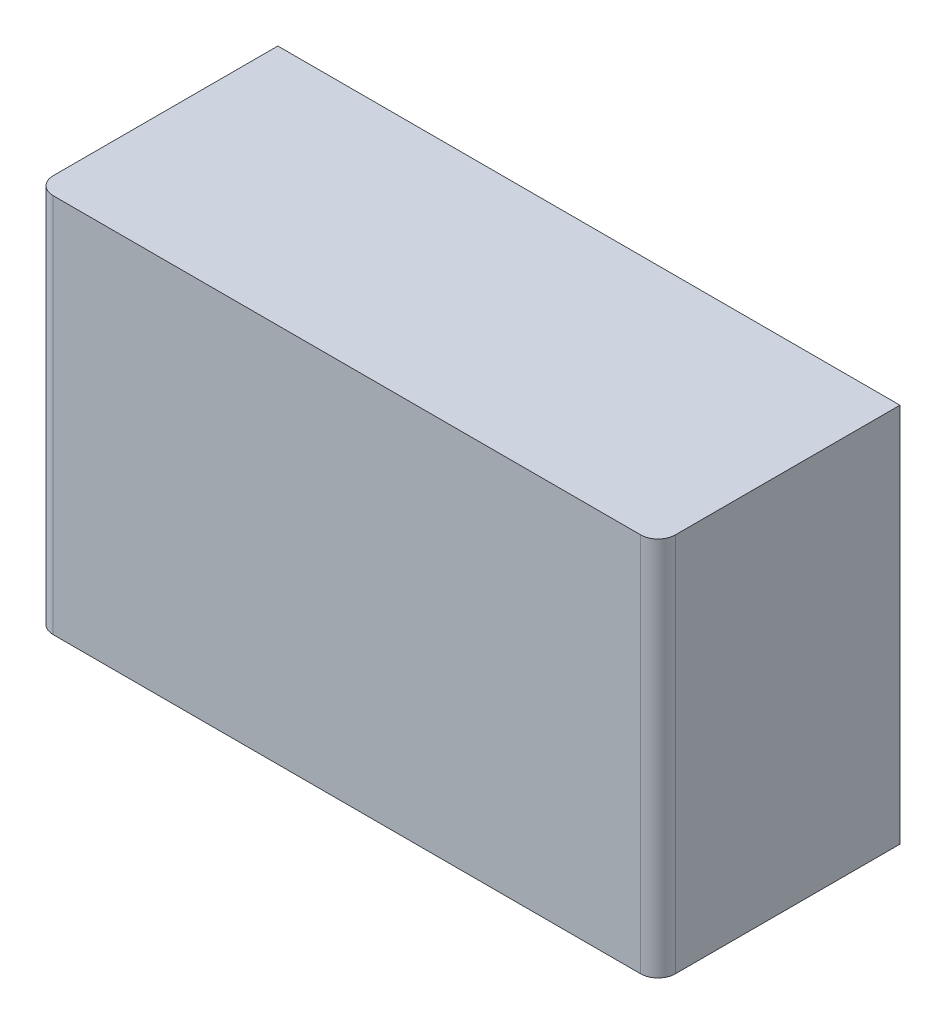
ISO-10303-21;
HEADER;
FILE_DESCRIPTION(('STEP AP214'),'2;1');
FILE_NAME('part.step','',(''),(''),'','','');
FILE_SCHEMA(('AUTOMOTIVE_DESIGN { 1 0 10303 214 1 1 1 1 }'));
ENDSEC;
DATA;
#1=APPLICATION_CONTEXT('core data for automotive mechanical design processes');
#2=APPLICATION_PROTOCOL_DEFINITION('international standard','automotive_design',2000,#1);
#3=PRODUCT_CONTEXT('',#1,'mechanical');
#4=PRODUCT('Part','Part','',(#3));
#5=PRODUCT_RELATED_PRODUCT_CATEGORY('part','',(#4));
#6=PRODUCT_DEFINITION_FORMATION('','',#4);
#7=PRODUCT_DEFINITION_CONTEXT('part definition',#1,'design');
#8=PRODUCT_DEFINITION('design','',#6,#7);
#9=PRODUCT_DEFINITION_SHAPE('','',#8);
#10=(LENGTH_UNIT() NAMED_UNIT(*) SI_UNIT(.MILLI.,.METRE.));
#11=(NAMED_UNIT(*) PLANE_ANGLE_UNIT() SI_UNIT($,.RADIAN.));
#12=(NAMED_UNIT(*) SI_UNIT($,.STERADIAN.) SOLID_ANGLE_UNIT());
#13=UNCERTAINTY_MEASURE_WITH_UNIT(LENGTH_MEASURE(1.E-05),#10,'distance_accuracy_value','');
#14=(GEOMETRIC_REPRESENTATION_CONTEXT(3) GLOBAL_UNCERTAINTY_ASSIGNED_CONTEXT((#13)) GLOBAL_UNIT_ASSIGNED_CONTEXT((#10,
#11,#12)) REPRESENTATION_CONTEXT('',''));
#15=CARTESIAN_POINT('',(0.,0.,0.));
#16=DIRECTION('',(0.,0.,1.));
#17=DIRECTION('',(1.,0.,0.));
#18=AXIS2_PLACEMENT_3D('',#15,#16,#17);
#19=CARTESIAN_POINT('',(457.2,558.8,177.8));
#20=DIRECTION('',(-1.,0.,0.));
#21=DIRECTION('',(0.,0.,1.));
#22=AXIS2_PLACEMENT_3D('',#19,#20,#21);
#23=PLANE('',#22);
#24=DIRECTION('',(0.,0.,-1.));
#25=VECTOR('',#24,1.);
#26=CARTESIAN_POINT('',(457.2,558.8,177.8));
#27=LINE('',#26,#25);
#28=CARTESIAN_POINT('',(457.2,558.8,152.4));
#29=VERTEX_POINT('',#28);
#30=CARTESIAN_POINT('',(457.2,558.8,-177.8));
#31=VERTEX_POINT('',#30);
#32=EDGE_CURVE('E87',#29,#31,#27,.T.);
#33=ORIENTED_EDGE('',*,*,#32,.F.);
#34=DIRECTION('',(0.,-1.,0.));
#35=VECTOR('',#34,1.);
#36=CARTESIAN_POINT('',(457.2,558.8,152.4));
#37=LINE('',#36,#35);
#38=CARTESIAN_POINT('',(457.2,0.,152.4));
#39=VERTEX_POINT('',#38);
#40=EDGE_CURVE('E110',#29,#39,#37,.T.);
#41=ORIENTED_EDGE('',*,*,#40,.T.);
#42=DIRECTION('',(0.,0.,-1.));
#43=VECTOR('',#42,1.);
#44=CARTESIAN_POINT('',(457.2,0.,177.8));
#45=LINE('',#44,#43);
#46=CARTESIAN_POINT('',(457.2,0.,-177.8));
#47=VERTEX_POINT('',#46);
#48=EDGE_CURVE('E108',#39,#47,#45,.T.);
#49=ORIENTED_EDGE('',*,*,#48,.T.);
#50=DIRECTION('',(0.,-1.,0.));
#51=VECTOR('',#50,1.);
#52=CARTESIAN_POINT('',(457.2,558.8,-177.8));
#53=LINE('',#52,#51);
#54=EDGE_CURVE('E102',#31,#47,#53,.T.);
#55=ORIENTED_EDGE('',*,*,#54,.F.);
#56=EDGE_LOOP('',(#33,#41,#49,#55));
#57=FACE_BOUND('',#56,.T.);
#58=ADVANCED_FACE('F33',(#57),#23,.F.);
#59=CARTESIAN_POINT('',(-457.2,558.8,-177.8));
#60=DIRECTION('',(0.,0.,1.));
#61=DIRECTION('',(1.,0.,0.));
#62=AXIS2_PLACEMENT_3D('',#59,#60,#61);
#63=PLANE('',#62);
#64=DIRECTION('',(-1.,0.,0.));
#65=VECTOR('',#64,1.);
#66=CARTESIAN_POINT('',(-457.2,0.,-177.8));
#67=LINE('',#66,#65);
#68=CARTESIAN_POINT('',(-457.2,0.,-177.8));
#69=VERTEX_POINT('',#68);
#70=EDGE_CURVE('E137',#47,#69,#67,.T.);
#71=ORIENTED_EDGE('',*,*,#70,.T.);
#72=DIRECTION('',(0.,-1.,0.));
#73=VECTOR('',#72,1.);
#74=CARTESIAN_POINT('',(-457.2,558.8,-177.8));
#75=LINE('',#74,#73);
#76=CARTESIAN_POINT('',(-457.2,558.8,-177.8));
#77=VERTEX_POINT('',#76);
#78=EDGE_CURVE('E104',#77,#69,#75,.T.);
#79=ORIENTED_EDGE('',*,*,#78,.F.);
#80=DIRECTION('',(-1.,0.,0.));
#81=VECTOR('',#80,1.);
#82=CARTESIAN_POINT('',(-457.2,558.8,-177.8));
#83=LINE('',#82,#81);
#84=EDGE_CURVE('E90',#31,#77,#83,.T.);
#85=ORIENTED_EDGE('',*,*,#84,.F.);
#86=ORIENTED_EDGE('',*,*,#54,.T.);
#87=EDGE_LOOP('',(#71,#79,#85,#86));
#88=FACE_BOUND('',#87,.T.);
#89=ADVANCED_FACE('F101',(#88),#63,.F.);
#90=CARTESIAN_POINT('',(-457.2,558.8,177.8));
#91=DIRECTION('',(1.,0.,0.));
#92=DIRECTION('',(0.,0.,-1.));
#93=AXIS2_PLACEMENT_3D('',#90,#91,#92);
#94=PLANE('',#93);
#95=DIRECTION('',(0.,0.,1.));
#96=VECTOR('',#95,1.);
#97=CARTESIAN_POINT('',(-457.2,0.,177.8));
#98=LINE('',#97,#96);
#99=CARTESIAN_POINT('',(-457.2,0.,152.4));
#100=VERTEX_POINT('',#99);
#101=EDGE_CURVE('E135',#69,#100,#98,.T.);
#102=ORIENTED_EDGE('',*,*,#101,.T.);
#103=DIRECTION('',(0.,-1.,0.));
#104=VECTOR('',#103,1.);
#105=CARTESIAN_POINT('',(-457.2,558.8,152.4));
#106=LINE('',#105,#104);
#107=CARTESIAN_POINT('',(-457.2,558.8,152.4));
#108=VERTEX_POINT('',#107);
#109=EDGE_CURVE('E11',#100,#108,#106,.F.);
#110=ORIENTED_EDGE('',*,*,#109,.T.);
#111=DIRECTION('',(0.,0.,1.));
#112=VECTOR('',#111,1.);
#113=CARTESIAN_POINT('',(-457.2,558.8,177.8));
#114=LINE('',#113,#112);
#115=EDGE_CURVE('E105',#77,#108,#114,.T.);
#116=ORIENTED_EDGE('',*,*,#115,.F.);
#117=ORIENTED_EDGE('',*,*,#78,.T.);
#118=EDGE_LOOP('',(#102,#110,#116,#117));
#119=FACE_BOUND('',#118,.T.);
#120=ADVANCED_FACE('F136',(#119),#94,.F.);
#121=CARTESIAN_POINT('',(-457.2,558.8,177.8));
#122=DIRECTION('',(0.,0.,-1.));
#123=DIRECTION('',(-1.,0.,0.));
#124=AXIS2_PLACEMENT_3D('',#121,#122,#123);
#125=PLANE('',#124);
#126=DIRECTION('',(1.,0.,0.));
#127=VECTOR('',#126,1.);
#128=CARTESIAN_POINT('',(-457.2,0.,177.8));
#129=LINE('',#128,#127);
#130=CARTESIAN_POINT('',(-431.8,0.,177.8));
#131=VERTEX_POINT('',#130);
#132=CARTESIAN_POINT('',(431.8,0.,177.8));
#133=VERTEX_POINT('',#132);
#134=EDGE_CURVE('E97',#131,#133,#129,.T.);
#135=ORIENTED_EDGE('',*,*,#134,.T.);
#136=DIRECTION('',(0.,-1.,0.));
#137=VECTOR('',#136,1.);
#138=CARTESIAN_POINT('',(431.8,558.8,177.8));
#139=LINE('',#138,#137);
#140=CARTESIAN_POINT('',(431.8,558.8,177.8));
#141=VERTEX_POINT('',#140);
#142=EDGE_CURVE('E54',#133,#141,#139,.F.);
#143=ORIENTED_EDGE('',*,*,#142,.T.);
#144=DIRECTION('',(1.,0.,0.));
#145=VECTOR('',#144,1.);
#146=CARTESIAN_POINT('',(-457.2,558.8,177.8));
#147=LINE('',#146,#145);
#148=CARTESIAN_POINT('',(-431.8,558.8,177.8));
#149=VERTEX_POINT('',#148);
#150=EDGE_CURVE('E114',#149,#141,#147,.T.);
#151=ORIENTED_EDGE('',*,*,#150,.F.);
#152=DIRECTION('',(0.,-1.,0.));
#153=VECTOR('',#152,1.);
#154=CARTESIAN_POINT('',(-431.8,558.8,177.8));
#155=LINE('',#154,#153);
#156=EDGE_CURVE('E121',#149,#131,#155,.T.);
#157=ORIENTED_EDGE('',*,*,#156,.T.);
#158=EDGE_LOOP('',(#135,#143,#151,#157));
#159=FACE_BOUND('',#158,.T.);
#160=ADVANCED_FACE('F129',(#159),#125,.F.);
#161=CARTESIAN_POINT('',(0.,558.8,0.));
#162=DIRECTION('',(0.,-1.,0.));
#163=DIRECTION('',(0.,0.,-1.));
#164=AXIS2_PLACEMENT_3D('',#161,#162,#163);
#165=PLANE('',#164);
#166=ORIENTED_EDGE('',*,*,#150,.T.);
#167=CARTESIAN_POINT('',(431.8,558.8,152.4));
#168=DIRECTION('',(0.,-1.,0.));
#169=DIRECTION('',(0.,0.,-1.));
#170=AXIS2_PLACEMENT_3D('',#167,#168,#169);
#171=CIRCLE('',#170,25.4);
#172=EDGE_CURVE('E41',#141,#29,#171,.F.);
#173=ORIENTED_EDGE('',*,*,#172,.T.);
#174=ORIENTED_EDGE('',*,*,#32,.T.);
#175=ORIENTED_EDGE('',*,*,#84,.T.);
#176=ORIENTED_EDGE('',*,*,#115,.T.);
#177=CARTESIAN_POINT('',(-431.8,558.8,152.4));
#178=DIRECTION('',(0.,-1.,0.));
#179=DIRECTION('',(0.,0.,-1.));
#180=AXIS2_PLACEMENT_3D('',#177,#178,#179);
#181=CIRCLE('',#180,25.4);
#182=EDGE_CURVE('E125',#108,#149,#181,.F.);
#183=ORIENTED_EDGE('',*,*,#182,.T.);
#184=EDGE_LOOP('',(#166,#173,#174,#175,#176,#183));
#185=FACE_BOUND('',#184,.T.);
#186=ADVANCED_FACE('F89',(#185),#165,.F.);
#187=CARTESIAN_POINT('',(0.,0.,0.));
#188=DIRECTION('',(0.,-1.,0.));
#189=DIRECTION('',(0.,0.,-1.));
#190=AXIS2_PLACEMENT_3D('',#187,#188,#189);
#191=PLANE('',#190);
#192=ORIENTED_EDGE('',*,*,#48,.F.);
#193=CARTESIAN_POINT('',(431.8,0.,152.4));
#194=DIRECTION('',(0.,-1.,0.));
#195=DIRECTION('',(0.,0.,-1.));
#196=AXIS2_PLACEMENT_3D('',#193,#194,#195);
#197=CIRCLE('',#196,25.4);
#198=EDGE_CURVE('E119',#39,#133,#197,.T.);
#199=ORIENTED_EDGE('',*,*,#198,.T.);
#200=ORIENTED_EDGE('',*,*,#134,.F.);
#201=CARTESIAN_POINT('',(-431.8,0.,152.4));
#202=DIRECTION('',(0.,-1.,0.));
#203=DIRECTION('',(0.,0.,-1.));
#204=AXIS2_PLACEMENT_3D('',#201,#202,#203);
#205=CIRCLE('',#204,25.4);
#206=EDGE_CURVE('E112',#131,#100,#205,.T.);
#207=ORIENTED_EDGE('',*,*,#206,.T.);
#208=ORIENTED_EDGE('',*,*,#101,.F.);
#209=ORIENTED_EDGE('',*,*,#70,.F.);
#210=EDGE_LOOP('',(#192,#199,#200,#207,#208,#209));
#211=FACE_BOUND('',#210,.T.);
#212=ADVANCED_FACE('F134',(#211),#191,.T.);
#213=CARTESIAN_POINT('',(431.8,558.8,152.4));
#214=DIRECTION('',(0.,-1.,0.));
#215=DIRECTION('',(0.,0.,-1.));
#216=AXIS2_PLACEMENT_3D('',#213,#214,#215);
#217=CYLINDRICAL_SURFACE('',#216,25.4);
#218=ORIENTED_EDGE('',*,*,#172,.F.);
#219=ORIENTED_EDGE('',*,*,#142,.F.);
#220=ORIENTED_EDGE('',*,*,#198,.F.);
#221=ORIENTED_EDGE('',*,*,#40,.F.);
#222=EDGE_LOOP('',(#218,#219,#220,#221));
#223=FACE_BOUND('',#222,.T.);
#224=ADVANCED_FACE('F143',(#223),#217,.T.);
#225=CARTESIAN_POINT('',(-431.8,558.8,152.4));
#226=DIRECTION('',(0.,-1.,0.));
#227=DIRECTION('',(0.,0.,-1.));
#228=AXIS2_PLACEMENT_3D('',#225,#226,#227);
#229=CYLINDRICAL_SURFACE('',#228,25.4);
#230=ORIENTED_EDGE('',*,*,#182,.F.);
#231=ORIENTED_EDGE('',*,*,#109,.F.);
#232=ORIENTED_EDGE('',*,*,#206,.F.);
#233=ORIENTED_EDGE('',*,*,#156,.F.);
#234=EDGE_LOOP('',(#230,#231,#232,#233));
#235=FACE_BOUND('',#234,.T.);
#236=ADVANCED_FACE('F35',(#235),#229,.T.);
#237=CLOSED_SHELL('',(#58,#89,#120,#160,#186,#212,#224,#236));
#238=MANIFOLD_SOLID_BREP('B2',#237);
#239=ADVANCED_BREP_SHAPE_REPRESENTATION('',(#18,#238),#14);
#240=SHAPE_DEFINITION_REPRESENTATION(#9,#239);
ENDSEC;
END-ISO-10303-21;
